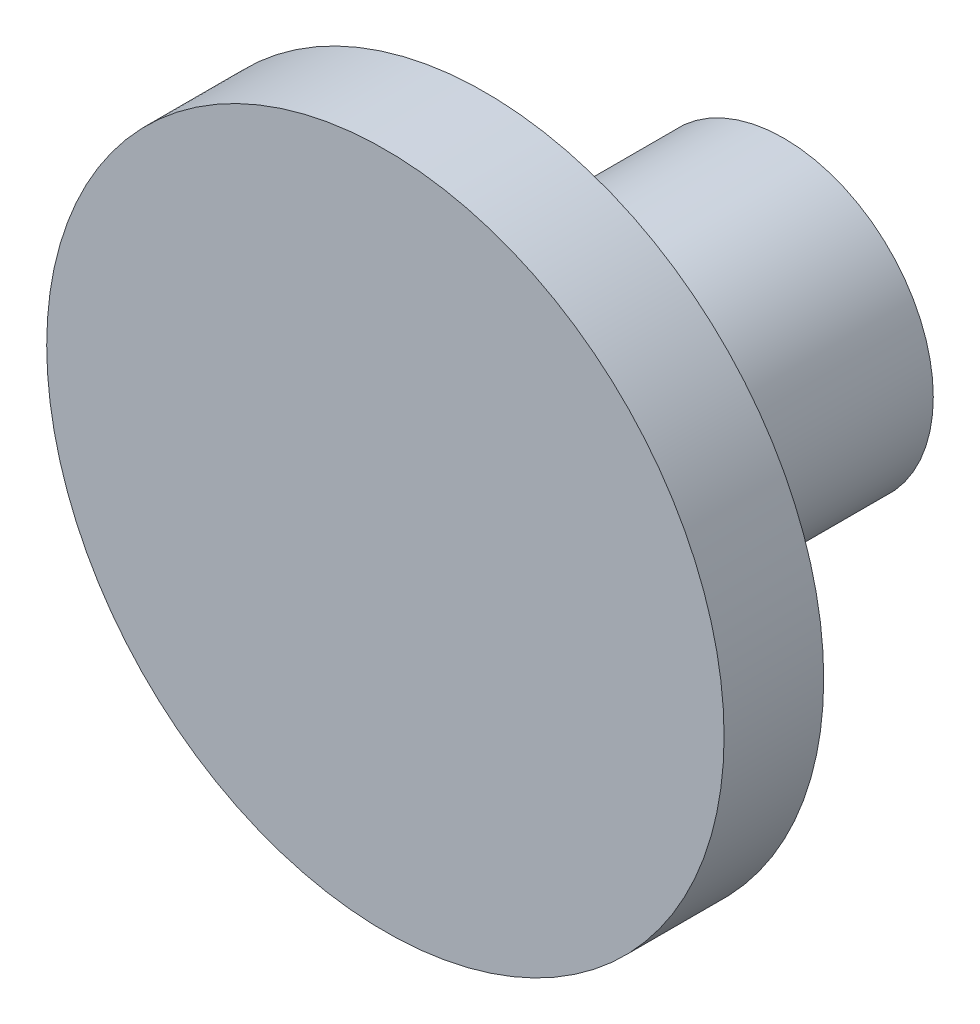
ISO-10303-21;
HEADER;
FILE_DESCRIPTION(('STEP AP214'),'2;1');
FILE_NAME('part.step','',(''),(''),'','','');
FILE_SCHEMA(('AUTOMOTIVE_DESIGN { 1 0 10303 214 1 1 1 1 }'));
ENDSEC;
DATA;
#1=APPLICATION_CONTEXT('core data for automotive mechanical design processes');
#2=APPLICATION_PROTOCOL_DEFINITION('international standard','automotive_design',2000,#1);
#3=PRODUCT_CONTEXT('',#1,'mechanical');
#4=PRODUCT('Part','Part','',(#3));
#5=PRODUCT_RELATED_PRODUCT_CATEGORY('part','',(#4));
#6=PRODUCT_DEFINITION_FORMATION('','',#4);
#7=PRODUCT_DEFINITION_CONTEXT('part definition',#1,'design');
#8=PRODUCT_DEFINITION('design','',#6,#7);
#9=PRODUCT_DEFINITION_SHAPE('','',#8);
#10=(LENGTH_UNIT() NAMED_UNIT(*) SI_UNIT(.MILLI.,.METRE.));
#11=(NAMED_UNIT(*) PLANE_ANGLE_UNIT() SI_UNIT($,.RADIAN.));
#12=(NAMED_UNIT(*) SI_UNIT($,.STERADIAN.) SOLID_ANGLE_UNIT());
#13=UNCERTAINTY_MEASURE_WITH_UNIT(LENGTH_MEASURE(1.E-05),#10,'distance_accuracy_value','');
#14=(GEOMETRIC_REPRESENTATION_CONTEXT(3) GLOBAL_UNCERTAINTY_ASSIGNED_CONTEXT((#13)) GLOBAL_UNIT_ASSIGNED_CONTEXT((#10,
#11,#12)) REPRESENTATION_CONTEXT('',''));
#15=CARTESIAN_POINT('',(0.,0.,0.));
#16=DIRECTION('',(0.,0.,1.));
#17=DIRECTION('',(1.,0.,0.));
#18=AXIS2_PLACEMENT_3D('',#15,#16,#17);
#19=CARTESIAN_POINT('',(0.,4.99999999999998,0.));
#20=DIRECTION('',(0.,0.,1.));
#21=DIRECTION('',(1.,0.,0.));
#22=AXIS2_PLACEMENT_3D('',#19,#20,#21);
#23=PLANE('',#22);
#24=CARTESIAN_POINT('',(0.,4.99999999999998,0.));
#25=DIRECTION('',(0.,0.,1.));
#26=DIRECTION('',(1.,0.,0.));
#27=AXIS2_PLACEMENT_3D('',#24,#25,#26);
#28=CIRCLE('',#27,1.5);
#29=CARTESIAN_POINT('',(1.5,4.99999999999998,0.));
#30=VERTEX_POINT('',#29);
#31=EDGE_CURVE('E10',#30,#30,#28,.T.);
#32=ORIENTED_EDGE('',*,*,#31,.F.);
#33=EDGE_LOOP('',(#32));
#34=FACE_BOUND('',#33,.T.);
#35=ADVANCED_FACE('F33',(#34),#23,.F.);
#36=CARTESIAN_POINT('',(0.,4.99999999999998,8.24264068711929));
#37=DIRECTION('',(0.,0.,-1.));
#38=DIRECTION('',(-1.,0.,0.));
#39=AXIS2_PLACEMENT_3D('',#36,#37,#38);
#40=CYLINDRICAL_SURFACE('',#39,1.5);
#41=CARTESIAN_POINT('',(0.,4.99999999999998,3.00000000000001));
#42=DIRECTION('',(0.,0.,-1.));
#43=DIRECTION('',(-1.,0.,0.));
#44=AXIS2_PLACEMENT_3D('',#41,#42,#43);
#45=CIRCLE('',#44,1.5);
#46=CARTESIAN_POINT('',(-1.5,4.99999999999998,3.00000000000001));
#47=VERTEX_POINT('',#46);
#48=EDGE_CURVE('E37',#47,#47,#45,.T.);
#49=ORIENTED_EDGE('',*,*,#48,.T.);
#50=EDGE_LOOP('',(#49));
#51=FACE_BOUND('',#50,.T.);
#52=ORIENTED_EDGE('',*,*,#31,.T.);
#53=EDGE_LOOP('',(#52));
#54=FACE_BOUND('',#53,.T.);
#55=ADVANCED_FACE('F35',(#51,#54),#40,.T.);
#56=CARTESIAN_POINT('',(0.,5.00000000000001,3.00000000000001));
#57=DIRECTION('',(0.,0.,1.));
#58=DIRECTION('',(1.,0.,0.));
#59=AXIS2_PLACEMENT_3D('',#56,#57,#58);
#60=CYLINDRICAL_SURFACE('',#59,3.4);
#61=CARTESIAN_POINT('',(0.,5.00000000000001,3.00000000000001));
#62=DIRECTION('',(0.,0.,-1.));
#63=DIRECTION('',(-1.,0.,0.));
#64=AXIS2_PLACEMENT_3D('',#61,#62,#63);
#65=CIRCLE('',#64,3.4);
#66=CARTESIAN_POINT('',(-3.4,5.00000000000001,3.00000000000001));
#67=VERTEX_POINT('',#66);
#68=EDGE_CURVE('E44',#67,#67,#65,.T.);
#69=ORIENTED_EDGE('',*,*,#68,.F.);
#70=EDGE_LOOP('',(#69));
#71=FACE_BOUND('',#70,.T.);
#72=CARTESIAN_POINT('',(0.,5.00000000000001,4.00000000000001));
#73=DIRECTION('',(0.,0.,-1.));
#74=DIRECTION('',(-1.,0.,0.));
#75=AXIS2_PLACEMENT_3D('',#72,#73,#74);
#76=CIRCLE('',#75,3.4);
#77=CARTESIAN_POINT('',(-3.4,5.00000000000001,4.00000000000001));
#78=VERTEX_POINT('',#77);
#79=EDGE_CURVE('E46',#78,#78,#76,.T.);
#80=ORIENTED_EDGE('',*,*,#79,.T.);
#81=EDGE_LOOP('',(#80));
#82=FACE_BOUND('',#81,.T.);
#83=ADVANCED_FACE('F54',(#71,#82),#60,.T.);
#84=CARTESIAN_POINT('',(0.,5.00000000000001,3.00000000000001));
#85=DIRECTION('',(0.,0.,-1.));
#86=DIRECTION('',(-1.,0.,0.));
#87=AXIS2_PLACEMENT_3D('',#84,#85,#86);
#88=PLANE('',#87);
#89=ORIENTED_EDGE('',*,*,#48,.F.);
#90=EDGE_LOOP('',(#89));
#91=FACE_BOUND('',#90,.T.);
#92=ORIENTED_EDGE('',*,*,#68,.T.);
#93=EDGE_LOOP('',(#92));
#94=FACE_BOUND('',#93,.T.);
#95=ADVANCED_FACE('F52',(#91,#94),#88,.T.);
#96=CARTESIAN_POINT('',(7.32817162390823,6.81670048454506,4.00000000000001));
#97=DIRECTION('',(0.,0.,-1.));
#98=DIRECTION('',(-0.240622580734445,0.97061875813354,0.));
#99=AXIS2_PLACEMENT_3D('',#96,#97,#98);
#100=PLANE('',#99);
#101=ORIENTED_EDGE('',*,*,#79,.F.);
#102=EDGE_LOOP('',(#101));
#103=FACE_BOUND('',#102,.T.);
#104=ADVANCED_FACE('F60',(#103),#100,.F.);
#105=CLOSED_SHELL('',(#35,#55,#83,#95,#104));
#106=MANIFOLD_SOLID_BREP('B2',#105);
#107=ADVANCED_BREP_SHAPE_REPRESENTATION('',(#18,#106),#14);
#108=SHAPE_DEFINITION_REPRESENTATION(#9,#107);
ENDSEC;
END-ISO-10303-21;
